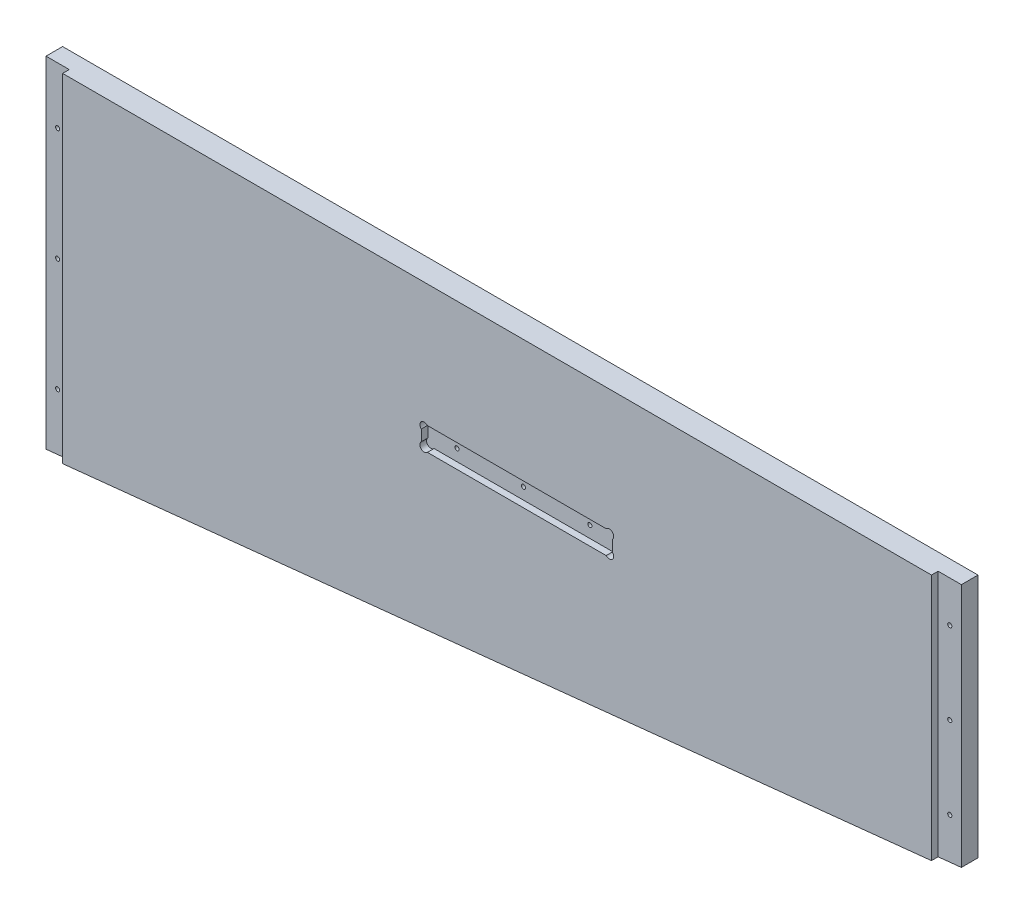
ISO-10303-21;
HEADER;
FILE_DESCRIPTION(('STEP AP214'),'2;1');
FILE_NAME('part.step','',(''),(''),'','','');
FILE_SCHEMA(('AUTOMOTIVE_DESIGN { 1 0 10303 214 1 1 1 1 }'));
ENDSEC;
DATA;
#1=APPLICATION_CONTEXT('core data for automotive mechanical design processes');
#2=APPLICATION_PROTOCOL_DEFINITION('international standard','automotive_design',2000,#1);
#3=PRODUCT_CONTEXT('',#1,'mechanical');
#4=PRODUCT('Part','Part','',(#3));
#5=PRODUCT_RELATED_PRODUCT_CATEGORY('part','',(#4));
#6=PRODUCT_DEFINITION_FORMATION('','',#4);
#7=PRODUCT_DEFINITION_CONTEXT('part definition',#1,'design');
#8=PRODUCT_DEFINITION('design','',#6,#7);
#9=PRODUCT_DEFINITION_SHAPE('','',#8);
#10=(LENGTH_UNIT() NAMED_UNIT(*) SI_UNIT(.MILLI.,.METRE.));
#11=(NAMED_UNIT(*) PLANE_ANGLE_UNIT() SI_UNIT($,.RADIAN.));
#12=(NAMED_UNIT(*) SI_UNIT($,.STERADIAN.) SOLID_ANGLE_UNIT());
#13=UNCERTAINTY_MEASURE_WITH_UNIT(LENGTH_MEASURE(1.E-05),#10,'distance_accuracy_value','');
#14=(GEOMETRIC_REPRESENTATION_CONTEXT(3) GLOBAL_UNCERTAINTY_ASSIGNED_CONTEXT((#13)) GLOBAL_UNIT_ASSIGNED_CONTEXT((#10,
#11,#12)) REPRESENTATION_CONTEXT('',''));
#15=CARTESIAN_POINT('',(0.,0.,0.));
#16=DIRECTION('',(0.,0.,1.));
#17=DIRECTION('',(1.,0.,0.));
#18=AXIS2_PLACEMENT_3D('',#15,#16,#17);
#19=CARTESIAN_POINT('',(839.47,-5504.1296031746,-17.78));
#20=DIRECTION('',(1.,0.,0.));
#21=DIRECTION('',(0.,0.,-1.));
#22=AXIS2_PLACEMENT_3D('',#19,#20,#21);
#23=PLANE('',#22);
#24=DIRECTION('',(0.,0.,1.));
#25=VECTOR('',#24,1.);
#26=CARTESIAN_POINT('',(839.47,-5504.1296031746,-17.78));
#27=LINE('',#26,#25);
#28=CARTESIAN_POINT('',(839.47,-5504.1296031746,-5.08));
#29=VERTEX_POINT('',#28);
#30=CARTESIAN_POINT('',(839.47,-5504.1296031746,0.));
#31=VERTEX_POINT('',#30);
#32=EDGE_CURVE('E585',#29,#31,#27,.T.);
#33=ORIENTED_EDGE('',*,*,#32,.F.);
#34=DIRECTION('',(0.,1.,0.));
#35=VECTOR('',#34,1.);
#36=CARTESIAN_POINT('',(839.47,-5504.1296031746,-5.08));
#37=LINE('',#36,#35);
#38=CARTESIAN_POINT('',(839.47,-5314.95,-5.08));
#39=VERTEX_POINT('',#38);
#40=EDGE_CURVE('E192',#29,#39,#37,.T.);
#41=ORIENTED_EDGE('',*,*,#40,.T.);
#42=DIRECTION('',(0.,0.,1.));
#43=VECTOR('',#42,1.);
#44=CARTESIAN_POINT('',(839.47,-5314.95,-17.78));
#45=LINE('',#44,#43);
#46=CARTESIAN_POINT('',(839.47,-5314.95,0.));
#47=VERTEX_POINT('',#46);
#48=EDGE_CURVE('E195',#39,#47,#45,.T.);
#49=ORIENTED_EDGE('',*,*,#48,.T.);
#50=DIRECTION('',(0.,1.,0.));
#51=VECTOR('',#50,1.);
#52=CARTESIAN_POINT('',(839.47,-5504.1296031746,0.));
#53=LINE('',#52,#51);
#54=EDGE_CURVE('E588',#31,#47,#53,.T.);
#55=ORIENTED_EDGE('',*,*,#54,.F.);
#56=EDGE_LOOP('',(#33,#41,#49,#55));
#57=FACE_BOUND('',#56,.T.);
#58=ADVANCED_FACE('F30',(#57),#23,.T.);
#59=CARTESIAN_POINT('',(174.9425,-5314.95,-17.78));
#60=DIRECTION('',(-1.,0.,0.));
#61=DIRECTION('',(0.,-1.,0.));
#62=AXIS2_PLACEMENT_3D('',#59,#60,#61);
#63=PLANE('',#62);
#64=DIRECTION('',(0.,0.,1.));
#65=VECTOR('',#64,1.);
#66=CARTESIAN_POINT('',(174.9425,-5314.95,-17.78));
#67=LINE('',#66,#65);
#68=CARTESIAN_POINT('',(174.9425,-5314.95,-5.08));
#69=VERTEX_POINT('',#68);
#70=CARTESIAN_POINT('',(174.9425,-5314.95,0.));
#71=VERTEX_POINT('',#70);
#72=EDGE_CURVE('E39',#69,#71,#67,.T.);
#73=ORIENTED_EDGE('',*,*,#72,.F.);
#74=DIRECTION('',(0.,-1.,0.));
#75=VECTOR('',#74,1.);
#76=CARTESIAN_POINT('',(174.9425,-5573.4453968254,-5.08));
#77=LINE('',#76,#75);
#78=CARTESIAN_POINT('',(174.9425,-5573.4453968254,-5.08));
#79=VERTEX_POINT('',#78);
#80=EDGE_CURVE('E610',#69,#79,#77,.T.);
#81=ORIENTED_EDGE('',*,*,#80,.T.);
#82=DIRECTION('',(0.,0.,1.));
#83=VECTOR('',#82,1.);
#84=CARTESIAN_POINT('',(174.9425,-5573.4453968254,-17.78));
#85=LINE('',#84,#83);
#86=CARTESIAN_POINT('',(174.9425,-5573.4453968254,0.));
#87=VERTEX_POINT('',#86);
#88=EDGE_CURVE('E11',#79,#87,#85,.T.);
#89=ORIENTED_EDGE('',*,*,#88,.T.);
#90=DIRECTION('',(0.,-1.,0.));
#91=VECTOR('',#90,1.);
#92=CARTESIAN_POINT('',(174.9425,-5314.95,0.));
#93=LINE('',#92,#91);
#94=EDGE_CURVE('E593',#71,#87,#93,.T.);
#95=ORIENTED_EDGE('',*,*,#94,.F.);
#96=EDGE_LOOP('',(#73,#81,#89,#95));
#97=FACE_BOUND('',#96,.T.);
#98=ADVANCED_FACE('F324',(#97),#63,.T.);
#99=CARTESIAN_POINT('',(174.9425,-5573.4453968254,-17.78));
#100=DIRECTION('',(0.10374552875936,-0.994603873540839,0.));
#101=DIRECTION('',(0.994603873540839,0.10374552875936,0.));
#102=AXIS2_PLACEMENT_3D('',#99,#100,#101);
#103=PLANE('',#102);
#104=DIRECTION('',(0.994603873540839,0.10374552875936,0.));
#105=VECTOR('',#104,1.);
#106=CARTESIAN_POINT('',(174.9425,-5573.4453968254,0.));
#107=LINE('',#106,#105);
#108=EDGE_CURVE('E582',#87,#31,#107,.T.);
#109=ORIENTED_EDGE('',*,*,#108,.F.);
#110=ORIENTED_EDGE('',*,*,#88,.F.);
#111=DIRECTION('',(-0.994603873540837,-0.103745528759374,0.));
#112=VECTOR('',#111,1.);
#113=CARTESIAN_POINT('',(157.1625,-5575.3,-5.08));
#114=LINE('',#113,#112);
#115=CARTESIAN_POINT('',(157.1625,-5575.3,-5.08));
#116=VERTEX_POINT('',#115);
#117=EDGE_CURVE('E614',#79,#116,#114,.T.);
#118=ORIENTED_EDGE('',*,*,#117,.T.);
#119=DIRECTION('',(0.,0.,-1.));
#120=VECTOR('',#119,1.);
#121=CARTESIAN_POINT('',(157.1625,-5575.3,-5.08));
#122=LINE('',#121,#120);
#123=CARTESIAN_POINT('',(157.1625,-5575.3,-17.78));
#124=VERTEX_POINT('',#123);
#125=EDGE_CURVE('E630',#116,#124,#122,.T.);
#126=ORIENTED_EDGE('',*,*,#125,.T.);
#127=DIRECTION('',(0.994603873540839,0.10374552875936,0.));
#128=VECTOR('',#127,1.);
#129=CARTESIAN_POINT('',(174.9425,-5573.4453968254,-17.78));
#130=LINE('',#129,#128);
#131=CARTESIAN_POINT('',(857.25,-5502.275,-17.78));
#132=VERTEX_POINT('',#131);
#133=EDGE_CURVE('E597',#124,#132,#130,.T.);
#134=ORIENTED_EDGE('',*,*,#133,.T.);
#135=DIRECTION('',(0.,0.,-1.));
#136=VECTOR('',#135,1.);
#137=CARTESIAN_POINT('',(857.25,-5502.275,-5.08));
#138=LINE('',#137,#136);
#139=CARTESIAN_POINT('',(857.25,-5502.275,-5.08));
#140=VERTEX_POINT('',#139);
#141=EDGE_CURVE('E627',#140,#132,#138,.T.);
#142=ORIENTED_EDGE('',*,*,#141,.F.);
#143=DIRECTION('',(-0.994603873540837,-0.103745528759374,0.));
#144=VECTOR('',#143,1.);
#145=CARTESIAN_POINT('',(857.25,-5502.275,-5.08));
#146=LINE('',#145,#144);
#147=EDGE_CURVE('E201',#140,#29,#146,.T.);
#148=ORIENTED_EDGE('',*,*,#147,.T.);
#149=ORIENTED_EDGE('',*,*,#32,.T.);
#150=EDGE_LOOP('',(#109,#110,#118,#126,#134,#142,#148,#149));
#151=FACE_BOUND('',#150,.T.);
#152=ADVANCED_FACE('F32',(#151),#103,.T.);
#153=CARTESIAN_POINT('',(839.47,-5314.95,-17.78));
#154=DIRECTION('',(0.,1.,0.));
#155=DIRECTION('',(0.,0.,1.));
#156=AXIS2_PLACEMENT_3D('',#153,#154,#155);
#157=PLANE('',#156);
#158=DIRECTION('',(-1.,0.,0.));
#159=VECTOR('',#158,1.);
#160=CARTESIAN_POINT('',(839.47,-5314.95,0.));
#161=LINE('',#160,#159);
#162=EDGE_CURVE('E595',#47,#71,#161,.T.);
#163=ORIENTED_EDGE('',*,*,#162,.F.);
#164=ORIENTED_EDGE('',*,*,#48,.F.);
#165=DIRECTION('',(1.,0.,0.));
#166=VECTOR('',#165,1.);
#167=CARTESIAN_POINT('',(839.47,-5314.95,-5.08));
#168=LINE('',#167,#166);
#169=CARTESIAN_POINT('',(857.25,-5314.95,-5.08));
#170=VERTEX_POINT('',#169);
#171=EDGE_CURVE('E55',#39,#170,#168,.T.);
#172=ORIENTED_EDGE('',*,*,#171,.T.);
#173=DIRECTION('',(0.,0.,-1.));
#174=VECTOR('',#173,1.);
#175=CARTESIAN_POINT('',(857.25,-5314.95,-5.08));
#176=LINE('',#175,#174);
#177=CARTESIAN_POINT('',(857.25,-5314.95,-17.78));
#178=VERTEX_POINT('',#177);
#179=EDGE_CURVE('E204',#170,#178,#176,.T.);
#180=ORIENTED_EDGE('',*,*,#179,.T.);
#181=DIRECTION('',(-1.,0.,0.));
#182=VECTOR('',#181,1.);
#183=CARTESIAN_POINT('',(839.47,-5314.95,-17.78));
#184=LINE('',#183,#182);
#185=CARTESIAN_POINT('',(157.1625,-5314.95,-17.78));
#186=VERTEX_POINT('',#185);
#187=EDGE_CURVE('E599',#178,#186,#184,.T.);
#188=ORIENTED_EDGE('',*,*,#187,.T.);
#189=DIRECTION('',(0.,0.,-1.));
#190=VECTOR('',#189,1.);
#191=CARTESIAN_POINT('',(157.1625,-5314.95,-5.08));
#192=LINE('',#191,#190);
#193=CARTESIAN_POINT('',(157.1625,-5314.95,-5.08));
#194=VERTEX_POINT('',#193);
#195=EDGE_CURVE('E589',#194,#186,#192,.T.);
#196=ORIENTED_EDGE('',*,*,#195,.F.);
#197=DIRECTION('',(1.,0.,0.));
#198=VECTOR('',#197,1.);
#199=CARTESIAN_POINT('',(174.9425,-5314.95,-5.08));
#200=LINE('',#199,#198);
#201=EDGE_CURVE('E624',#194,#69,#200,.T.);
#202=ORIENTED_EDGE('',*,*,#201,.T.);
#203=ORIENTED_EDGE('',*,*,#72,.T.);
#204=EDGE_LOOP('',(#163,#164,#172,#180,#188,#196,#202,#203));
#205=FACE_BOUND('',#204,.T.);
#206=ADVANCED_FACE('F333',(#205),#157,.T.);
#207=CARTESIAN_POINT('',(174.9425,-5573.4453968254,-17.78));
#208=DIRECTION('',(0.,0.,-1.));
#209=DIRECTION('',(-1.,0.,0.));
#210=AXIS2_PLACEMENT_3D('',#207,#208,#209);
#211=PLANE('',#210);
#212=CARTESIAN_POINT('',(471.4875,-5417.566,-17.78));
#213=DIRECTION('',(0.,0.,-1.));
#214=DIRECTION('',(-1.,0.,0.));
#215=AXIS2_PLACEMENT_3D('',#212,#213,#214);
#216=CIRCLE('',#215,1.58749999999969);
#217=CARTESIAN_POINT('',(469.9,-5417.566,-17.78));
#218=VERTEX_POINT('',#217);
#219=EDGE_CURVE('E246',#218,#218,#216,.F.);
#220=ORIENTED_EDGE('',*,*,#219,.T.);
#221=EDGE_LOOP('',(#220));
#222=FACE_BOUND('',#221,.T.);
#223=CARTESIAN_POINT('',(522.2875,-5417.566,-17.78));
#224=DIRECTION('',(0.,0.,-1.));
#225=DIRECTION('',(-1.,0.,0.));
#226=AXIS2_PLACEMENT_3D('',#223,#224,#225);
#227=CIRCLE('',#226,1.58749999999964);
#228=CARTESIAN_POINT('',(520.7,-5417.566,-17.78));
#229=VERTEX_POINT('',#228);
#230=EDGE_CURVE('E236',#229,#229,#227,.F.);
#231=ORIENTED_EDGE('',*,*,#230,.T.);
#232=EDGE_LOOP('',(#231));
#233=FACE_BOUND('',#232,.T.);
#234=CARTESIAN_POINT('',(573.0875,-5417.566,-17.78));
#235=DIRECTION('',(0.,0.,-1.));
#236=DIRECTION('',(-1.,0.,0.));
#237=AXIS2_PLACEMENT_3D('',#234,#235,#236);
#238=CIRCLE('',#237,1.58749999999985);
#239=CARTESIAN_POINT('',(571.5,-5417.566,-17.78));
#240=VERTEX_POINT('',#239);
#241=EDGE_CURVE('E233',#240,#240,#238,.F.);
#242=ORIENTED_EDGE('',*,*,#241,.T.);
#243=EDGE_LOOP('',(#242));
#244=FACE_BOUND('',#243,.T.);
#245=CARTESIAN_POINT('',(848.36,-5346.32538359912,-17.78));
#246=DIRECTION('',(0.,0.,-1.));
#247=DIRECTION('',(-1.,0.,0.));
#248=AXIS2_PLACEMENT_3D('',#245,#246,#247);
#249=CIRCLE('',#248,1.58749999999985);
#250=CARTESIAN_POINT('',(846.7725,-5346.32538359912,-17.78));
#251=VERTEX_POINT('',#250);
#252=EDGE_CURVE('E230',#251,#251,#249,.F.);
#253=ORIENTED_EDGE('',*,*,#252,.T.);
#254=EDGE_LOOP('',(#253));
#255=FACE_BOUND('',#254,.T.);
#256=CARTESIAN_POINT('',(848.36,-5409.07615079482,-17.78));
#257=DIRECTION('',(0.,0.,-1.));
#258=DIRECTION('',(-1.,0.,0.));
#259=AXIS2_PLACEMENT_3D('',#256,#257,#258);
#260=CIRCLE('',#259,1.58749999999996);
#261=CARTESIAN_POINT('',(846.7725,-5409.07615079482,-17.78));
#262=VERTEX_POINT('',#261);
#263=EDGE_CURVE('E226',#262,#262,#260,.F.);
#264=ORIENTED_EDGE('',*,*,#263,.T.);
#265=EDGE_LOOP('',(#264));
#266=FACE_BOUND('',#265,.T.);
#267=CARTESIAN_POINT('',(848.36,-5471.82691799052,-17.78));
#268=DIRECTION('',(0.,0.,-1.));
#269=DIRECTION('',(-1.,0.,0.));
#270=AXIS2_PLACEMENT_3D('',#267,#268,#269);
#271=CIRCLE('',#270,1.58749999999964);
#272=CARTESIAN_POINT('',(846.7725,-5471.82691799052,-17.78));
#273=VERTEX_POINT('',#272);
#274=EDGE_CURVE('E222',#273,#273,#271,.F.);
#275=ORIENTED_EDGE('',*,*,#274,.T.);
#276=EDGE_LOOP('',(#275));
#277=FACE_BOUND('',#276,.T.);
#278=CARTESIAN_POINT('',(166.0525,-5358.18711640088,-17.78));
#279=DIRECTION('',(0.,0.,-1.));
#280=DIRECTION('',(-1.,0.,0.));
#281=AXIS2_PLACEMENT_3D('',#278,#279,#280);
#282=CIRCLE('',#281,1.58750000000006);
#283=CARTESIAN_POINT('',(164.465,-5358.18711640088,-17.78));
#284=VERTEX_POINT('',#283);
#285=EDGE_CURVE('E218',#284,#284,#282,.F.);
#286=ORIENTED_EDGE('',*,*,#285,.T.);
#287=EDGE_LOOP('',(#286));
#288=FACE_BOUND('',#287,.T.);
#289=CARTESIAN_POINT('',(166.0525,-5444.66134920518,-17.78));
#290=DIRECTION('',(0.,0.,-1.));
#291=DIRECTION('',(-1.,0.,0.));
#292=AXIS2_PLACEMENT_3D('',#289,#290,#291);
#293=CIRCLE('',#292,1.58749999999974);
#294=CARTESIAN_POINT('',(164.465,-5444.66134920518,-17.78));
#295=VERTEX_POINT('',#294);
#296=EDGE_CURVE('E214',#295,#295,#293,.F.);
#297=ORIENTED_EDGE('',*,*,#296,.T.);
#298=EDGE_LOOP('',(#297));
#299=FACE_BOUND('',#298,.T.);
#300=CARTESIAN_POINT('',(166.0525,-5531.13558200948,-17.78));
#301=DIRECTION('',(0.,0.,-1.));
#302=DIRECTION('',(-1.,0.,0.));
#303=AXIS2_PLACEMENT_3D('',#300,#301,#302);
#304=CIRCLE('',#303,1.58750000000025);
#305=CARTESIAN_POINT('',(164.465,-5531.13558200948,-17.78));
#306=VERTEX_POINT('',#305);
#307=EDGE_CURVE('E210',#306,#306,#304,.F.);
#308=ORIENTED_EDGE('',*,*,#307,.T.);
#309=EDGE_LOOP('',(#308));
#310=FACE_BOUND('',#309,.T.);
#311=ORIENTED_EDGE('',*,*,#133,.F.);
#312=DIRECTION('',(0.,1.,0.));
#313=VECTOR('',#312,1.);
#314=CARTESIAN_POINT('',(157.1625,-5314.95,-17.78));
#315=LINE('',#314,#313);
#316=EDGE_CURVE('E615',#124,#186,#315,.T.);
#317=ORIENTED_EDGE('',*,*,#316,.T.);
#318=ORIENTED_EDGE('',*,*,#187,.F.);
#319=DIRECTION('',(0.,-1.,0.));
#320=VECTOR('',#319,1.);
#321=CARTESIAN_POINT('',(857.25,-5314.95,-17.78));
#322=LINE('',#321,#320);
#323=EDGE_CURVE('E171',#178,#132,#322,.T.);
#324=ORIENTED_EDGE('',*,*,#323,.T.);
#325=EDGE_LOOP('',(#311,#317,#318,#324));
#326=FACE_BOUND('',#325,.T.);
#327=ADVANCED_FACE('F335',(#222,#233,#244,#255,#266,#277,#288,#299,#310,#326),#211,.T.);
#328=CARTESIAN_POINT('',(174.9425,-5573.4453968254,0.));
#329=DIRECTION('',(0.,0.,-1.));
#330=DIRECTION('',(-1.,0.,0.));
#331=AXIS2_PLACEMENT_3D('',#328,#329,#330);
#332=PLANE('',#331);
#333=DIRECTION('',(-1.,0.,0.));
#334=VECTOR('',#333,1.);
#335=CARTESIAN_POINT('',(595.312500001227,-5408.67600000123,0.));
#336=LINE('',#335,#334);
#337=CARTESIAN_POINT('',(590.646095122434,-5408.67600000123,0.));
#338=VERTEX_POINT('',#337);
#339=CARTESIAN_POINT('',(453.928904877565,-5408.67600000123,0.));
#340=VERTEX_POINT('',#339);
#341=EDGE_CURVE('E185',#338,#340,#336,.T.);
#342=ORIENTED_EDGE('',*,*,#341,.F.);
#343=CARTESIAN_POINT('',(593.067435970959,-5410.9210640315,0.));
#344=DIRECTION('',(0.,0.,1.));
#345=DIRECTION('',(1.,0.,0.));
#346=AXIS2_PLACEMENT_3D('',#343,#344,#345);
#347=CIRCLE('',#346,3.30200000071786);
#348=CARTESIAN_POINT('',(595.312500001227,-5413.34240488002,0.));
#349=VERTEX_POINT('',#348);
#350=EDGE_CURVE('E154',#349,#338,#347,.T.);
#351=ORIENTED_EDGE('',*,*,#350,.F.);
#352=DIRECTION('',(0.,1.,0.));
#353=VECTOR('',#352,1.);
#354=CARTESIAN_POINT('',(595.312500001227,-5408.67600000123,0.));
#355=LINE('',#354,#353);
#356=CARTESIAN_POINT('',(595.312500001227,-5421.78959512341,0.));
#357=VERTEX_POINT('',#356);
#358=EDGE_CURVE('E163',#357,#349,#355,.T.);
#359=ORIENTED_EDGE('',*,*,#358,.F.);
#360=CARTESIAN_POINT('',(593.06743597096,-5424.21093597096,0.));
#361=DIRECTION('',(0.,0.,1.));
#362=DIRECTION('',(1.,0.,0.));
#363=AXIS2_PLACEMENT_3D('',#360,#361,#362);
#364=CIRCLE('',#363,3.30200000000012);
#365=CARTESIAN_POINT('',(590.646095123413,-5426.45600000123,0.));
#366=VERTEX_POINT('',#365);
#367=EDGE_CURVE('E263',#366,#357,#364,.T.);
#368=ORIENTED_EDGE('',*,*,#367,.F.);
#369=DIRECTION('',(1.,0.,0.));
#370=VECTOR('',#369,1.);
#371=CARTESIAN_POINT('',(449.262499998773,-5426.45600000123,0.));
#372=LINE('',#371,#370);
#373=CARTESIAN_POINT('',(453.928904876584,-5426.45600000123,0.));
#374=VERTEX_POINT('',#373);
#375=EDGE_CURVE('E180',#374,#366,#372,.T.);
#376=ORIENTED_EDGE('',*,*,#375,.F.);
#377=CARTESIAN_POINT('',(451.507564029041,-5424.21093597096,0.));
#378=DIRECTION('',(0.,0.,1.));
#379=DIRECTION('',(1.,0.,0.));
#380=AXIS2_PLACEMENT_3D('',#377,#378,#379);
#381=CIRCLE('',#380,3.30199999999822);
#382=CARTESIAN_POINT('',(449.262499998773,-5421.78959512341,0.));
#383=VERTEX_POINT('',#382);
#384=EDGE_CURVE('E271',#383,#374,#381,.T.);
#385=ORIENTED_EDGE('',*,*,#384,.F.);
#386=DIRECTION('',(0.,-1.,0.));
#387=VECTOR('',#386,1.);
#388=CARTESIAN_POINT('',(449.262499998773,-5408.67600000123,0.));
#389=LINE('',#388,#387);
#390=CARTESIAN_POINT('',(449.262499998773,-5413.34240488002,0.));
#391=VERTEX_POINT('',#390);
#392=EDGE_CURVE('E177',#391,#383,#389,.T.);
#393=ORIENTED_EDGE('',*,*,#392,.F.);
#394=CARTESIAN_POINT('',(451.50756402904,-5410.9210640315,0.));
#395=DIRECTION('',(0.,0.,1.));
#396=DIRECTION('',(1.,0.,0.));
#397=AXIS2_PLACEMENT_3D('',#394,#395,#396);
#398=CIRCLE('',#397,3.30200000071828);
#399=EDGE_CURVE('E280',#340,#391,#398,.T.);
#400=ORIENTED_EDGE('',*,*,#399,.F.);
#401=EDGE_LOOP('',(#342,#351,#359,#368,#376,#385,#393,#400));
#402=FACE_BOUND('',#401,.T.);
#403=ORIENTED_EDGE('',*,*,#108,.T.);
#404=ORIENTED_EDGE('',*,*,#54,.T.);
#405=ORIENTED_EDGE('',*,*,#162,.T.);
#406=ORIENTED_EDGE('',*,*,#94,.T.);
#407=EDGE_LOOP('',(#403,#404,#405,#406));
#408=FACE_BOUND('',#407,.T.);
#409=ADVANCED_FACE('F300',(#402,#408),#332,.F.);
#410=CARTESIAN_POINT('',(157.1625,-5314.95,-5.08));
#411=DIRECTION('',(-1.,0.,0.));
#412=DIRECTION('',(0.,-1.,0.));
#413=AXIS2_PLACEMENT_3D('',#410,#411,#412);
#414=PLANE('',#413);
#415=ORIENTED_EDGE('',*,*,#316,.F.);
#416=ORIENTED_EDGE('',*,*,#125,.F.);
#417=DIRECTION('',(0.,1.,0.));
#418=VECTOR('',#417,1.);
#419=CARTESIAN_POINT('',(157.1625,-5314.95,-5.08));
#420=LINE('',#419,#418);
#421=EDGE_CURVE('E621',#116,#194,#420,.T.);
#422=ORIENTED_EDGE('',*,*,#421,.T.);
#423=ORIENTED_EDGE('',*,*,#195,.T.);
#424=EDGE_LOOP('',(#415,#416,#422,#423));
#425=FACE_BOUND('',#424,.T.);
#426=ADVANCED_FACE('F340',(#425),#414,.T.);
#427=CARTESIAN_POINT('',(174.9425,-5314.95,-5.08));
#428=DIRECTION('',(0.,0.,1.));
#429=DIRECTION('',(1.,0.,0.));
#430=AXIS2_PLACEMENT_3D('',#427,#428,#429);
#431=PLANE('',#430);
#432=CARTESIAN_POINT('',(166.0525,-5358.18711640088,-5.08));
#433=DIRECTION('',(0.,0.,1.));
#434=DIRECTION('',(1.,0.,0.));
#435=AXIS2_PLACEMENT_3D('',#432,#433,#434);
#436=CIRCLE('',#435,1.58750000000006);
#437=CARTESIAN_POINT('',(167.64,-5358.18711640088,-5.08));
#438=VERTEX_POINT('',#437);
#439=EDGE_CURVE('E215',#438,#438,#436,.T.);
#440=ORIENTED_EDGE('',*,*,#439,.F.);
#441=EDGE_LOOP('',(#440));
#442=FACE_BOUND('',#441,.T.);
#443=CARTESIAN_POINT('',(166.0525,-5444.66134920518,-5.08));
#444=DIRECTION('',(0.,0.,1.));
#445=DIRECTION('',(1.,0.,0.));
#446=AXIS2_PLACEMENT_3D('',#443,#444,#445);
#447=CIRCLE('',#446,1.58749999999974);
#448=CARTESIAN_POINT('',(167.64,-5444.66134920518,-5.08));
#449=VERTEX_POINT('',#448);
#450=EDGE_CURVE('E211',#449,#449,#447,.T.);
#451=ORIENTED_EDGE('',*,*,#450,.F.);
#452=EDGE_LOOP('',(#451));
#453=FACE_BOUND('',#452,.T.);
#454=CARTESIAN_POINT('',(166.0525,-5531.13558200948,-5.08));
#455=DIRECTION('',(0.,0.,1.));
#456=DIRECTION('',(1.,0.,0.));
#457=AXIS2_PLACEMENT_3D('',#454,#455,#456);
#458=CIRCLE('',#457,1.58750000000025);
#459=CARTESIAN_POINT('',(167.64,-5531.13558200948,-5.08));
#460=VERTEX_POINT('',#459);
#461=EDGE_CURVE('E207',#460,#460,#458,.T.);
#462=ORIENTED_EDGE('',*,*,#461,.F.);
#463=EDGE_LOOP('',(#462));
#464=FACE_BOUND('',#463,.T.);
#465=ORIENTED_EDGE('',*,*,#80,.F.);
#466=ORIENTED_EDGE('',*,*,#201,.F.);
#467=ORIENTED_EDGE('',*,*,#421,.F.);
#468=ORIENTED_EDGE('',*,*,#117,.F.);
#469=EDGE_LOOP('',(#465,#466,#467,#468));
#470=FACE_BOUND('',#469,.T.);
#471=ADVANCED_FACE('F346',(#442,#453,#464,#470),#431,.T.);
#472=CARTESIAN_POINT('',(857.25,-5314.95,-5.08));
#473=DIRECTION('',(1.,0.,0.));
#474=DIRECTION('',(0.,0.,-1.));
#475=AXIS2_PLACEMENT_3D('',#472,#473,#474);
#476=PLANE('',#475);
#477=ORIENTED_EDGE('',*,*,#323,.F.);
#478=ORIENTED_EDGE('',*,*,#179,.F.);
#479=DIRECTION('',(0.,-1.,0.));
#480=VECTOR('',#479,1.);
#481=CARTESIAN_POINT('',(857.25,-5314.95,-5.08));
#482=LINE('',#481,#480);
#483=EDGE_CURVE('E189',#170,#140,#482,.T.);
#484=ORIENTED_EDGE('',*,*,#483,.T.);
#485=ORIENTED_EDGE('',*,*,#141,.T.);
#486=EDGE_LOOP('',(#477,#478,#484,#485));
#487=FACE_BOUND('',#486,.T.);
#488=ADVANCED_FACE('F350',(#487),#476,.T.);
#489=CARTESIAN_POINT('',(839.47,-5314.95,-5.08));
#490=DIRECTION('',(0.,0.,-1.));
#491=DIRECTION('',(-1.,0.,0.));
#492=AXIS2_PLACEMENT_3D('',#489,#490,#491);
#493=PLANE('',#492);
#494=CARTESIAN_POINT('',(848.36,-5346.32538359912,-5.08));
#495=DIRECTION('',(0.,0.,-1.));
#496=DIRECTION('',(-1.,0.,0.));
#497=AXIS2_PLACEMENT_3D('',#494,#495,#496);
#498=CIRCLE('',#497,1.58749999999985);
#499=CARTESIAN_POINT('',(846.7725,-5346.32538359912,-5.08));
#500=VERTEX_POINT('',#499);
#501=EDGE_CURVE('E227',#500,#500,#498,.T.);
#502=ORIENTED_EDGE('',*,*,#501,.T.);
#503=EDGE_LOOP('',(#502));
#504=FACE_BOUND('',#503,.T.);
#505=CARTESIAN_POINT('',(848.36,-5409.07615079482,-5.08));
#506=DIRECTION('',(0.,0.,-1.));
#507=DIRECTION('',(-1.,0.,0.));
#508=AXIS2_PLACEMENT_3D('',#505,#506,#507);
#509=CIRCLE('',#508,1.58749999999996);
#510=CARTESIAN_POINT('',(846.7725,-5409.07615079482,-5.08));
#511=VERTEX_POINT('',#510);
#512=EDGE_CURVE('E223',#511,#511,#509,.T.);
#513=ORIENTED_EDGE('',*,*,#512,.T.);
#514=EDGE_LOOP('',(#513));
#515=FACE_BOUND('',#514,.T.);
#516=CARTESIAN_POINT('',(848.36,-5471.82691799052,-5.08));
#517=DIRECTION('',(0.,0.,-1.));
#518=DIRECTION('',(-1.,0.,0.));
#519=AXIS2_PLACEMENT_3D('',#516,#517,#518);
#520=CIRCLE('',#519,1.58749999999964);
#521=CARTESIAN_POINT('',(846.7725,-5471.82691799052,-5.08));
#522=VERTEX_POINT('',#521);
#523=EDGE_CURVE('E219',#522,#522,#520,.T.);
#524=ORIENTED_EDGE('',*,*,#523,.T.);
#525=EDGE_LOOP('',(#524));
#526=FACE_BOUND('',#525,.T.);
#527=ORIENTED_EDGE('',*,*,#40,.F.);
#528=ORIENTED_EDGE('',*,*,#147,.F.);
#529=ORIENTED_EDGE('',*,*,#483,.F.);
#530=ORIENTED_EDGE('',*,*,#171,.F.);
#531=EDGE_LOOP('',(#527,#528,#529,#530));
#532=FACE_BOUND('',#531,.T.);
#533=ADVANCED_FACE('F354',(#504,#515,#526,#532),#493,.F.);
#534=CARTESIAN_POINT('',(449.262499998773,-5408.67600000123,-5.08));
#535=DIRECTION('',(-1.,0.,0.));
#536=DIRECTION('',(0.,0.,1.));
#537=AXIS2_PLACEMENT_3D('',#534,#535,#536);
#538=PLANE('',#537);
#539=ORIENTED_EDGE('',*,*,#392,.T.);
#540=DIRECTION('',(0.,0.,1.));
#541=VECTOR('',#540,1.);
#542=CARTESIAN_POINT('',(449.262499998773,-5421.78959512341,-14.4194663679435));
#543=LINE('',#542,#541);
#544=CARTESIAN_POINT('',(449.262499998772,-5421.78959512341,-5.08));
#545=VERTEX_POINT('',#544);
#546=EDGE_CURVE('E277',#383,#545,#543,.F.);
#547=ORIENTED_EDGE('',*,*,#546,.T.);
#548=DIRECTION('',(0.,-1.,0.));
#549=VECTOR('',#548,1.);
#550=CARTESIAN_POINT('',(449.262499998773,-5408.67600000123,-5.08));
#551=LINE('',#550,#549);
#552=CARTESIAN_POINT('',(449.262499998773,-5413.34240488002,-5.08));
#553=VERTEX_POINT('',#552);
#554=EDGE_CURVE('E173',#553,#545,#551,.T.);
#555=ORIENTED_EDGE('',*,*,#554,.F.);
#556=DIRECTION('',(0.,0.,1.));
#557=VECTOR('',#556,1.);
#558=CARTESIAN_POINT('',(449.262499998773,-5413.34240488002,-14.4194663679435));
#559=LINE('',#558,#557);
#560=EDGE_CURVE('E181',#553,#391,#559,.T.);
#561=ORIENTED_EDGE('',*,*,#560,.T.);
#562=EDGE_LOOP('',(#539,#547,#555,#561));
#563=FACE_BOUND('',#562,.T.);
#564=ADVANCED_FACE('F292',(#563),#538,.F.);
#565=CARTESIAN_POINT('',(595.312500001227,-5408.67600000123,-5.08));
#566=DIRECTION('',(0.,1.,0.));
#567=DIRECTION('',(0.,0.,1.));
#568=AXIS2_PLACEMENT_3D('',#565,#566,#567);
#569=PLANE('',#568);
#570=DIRECTION('',(-1.,0.,0.));
#571=VECTOR('',#570,1.);
#572=CARTESIAN_POINT('',(595.312500001227,-5408.67600000123,-5.08));
#573=LINE('',#572,#571);
#574=CARTESIAN_POINT('',(590.646095122434,-5408.67600000123,-5.08));
#575=VERTEX_POINT('',#574);
#576=CARTESIAN_POINT('',(453.928904877565,-5408.67600000123,-5.08));
#577=VERTEX_POINT('',#576);
#578=EDGE_CURVE('E168',#575,#577,#573,.T.);
#579=ORIENTED_EDGE('',*,*,#578,.F.);
#580=DIRECTION('',(0.,0.,1.));
#581=VECTOR('',#580,1.);
#582=CARTESIAN_POINT('',(590.646095122434,-5408.67600000123,-14.4194663679435));
#583=LINE('',#582,#581);
#584=EDGE_CURVE('E151',#575,#338,#583,.T.);
#585=ORIENTED_EDGE('',*,*,#584,.T.);
#586=ORIENTED_EDGE('',*,*,#341,.T.);
#587=DIRECTION('',(0.,0.,1.));
#588=VECTOR('',#587,1.);
#589=CARTESIAN_POINT('',(453.928904877565,-5408.67600000123,-14.4194663679435));
#590=LINE('',#589,#588);
#591=EDGE_CURVE('E285',#340,#577,#590,.F.);
#592=ORIENTED_EDGE('',*,*,#591,.T.);
#593=EDGE_LOOP('',(#579,#585,#586,#592));
#594=FACE_BOUND('',#593,.T.);
#595=ADVANCED_FACE('F310',(#594),#569,.F.);
#596=CARTESIAN_POINT('',(595.312500001227,-5408.67600000123,-5.08));
#597=DIRECTION('',(1.,0.,0.));
#598=DIRECTION('',(0.,0.,-1.));
#599=AXIS2_PLACEMENT_3D('',#596,#597,#598);
#600=PLANE('',#599);
#601=ORIENTED_EDGE('',*,*,#358,.T.);
#602=DIRECTION('',(0.,0.,1.));
#603=VECTOR('',#602,1.);
#604=CARTESIAN_POINT('',(595.312500001227,-5413.34240488002,-14.4194663679435));
#605=LINE('',#604,#603);
#606=CARTESIAN_POINT('',(595.312500001227,-5413.34240488002,-5.08));
#607=VERTEX_POINT('',#606);
#608=EDGE_CURVE('E148',#349,#607,#605,.F.);
#609=ORIENTED_EDGE('',*,*,#608,.T.);
#610=DIRECTION('',(0.,1.,0.));
#611=VECTOR('',#610,1.);
#612=CARTESIAN_POINT('',(595.312500001227,-5408.67600000123,-5.08));
#613=LINE('',#612,#611);
#614=CARTESIAN_POINT('',(595.312500001227,-5421.78959512341,-5.08));
#615=VERTEX_POINT('',#614);
#616=EDGE_CURVE('E161',#615,#607,#613,.T.);
#617=ORIENTED_EDGE('',*,*,#616,.F.);
#618=DIRECTION('',(0.,0.,1.));
#619=VECTOR('',#618,1.);
#620=CARTESIAN_POINT('',(595.312500001227,-5421.78959512341,-14.4194663679435));
#621=LINE('',#620,#619);
#622=EDGE_CURVE('E269',#615,#357,#621,.T.);
#623=ORIENTED_EDGE('',*,*,#622,.T.);
#624=EDGE_LOOP('',(#601,#609,#617,#623));
#625=FACE_BOUND('',#624,.T.);
#626=ADVANCED_FACE('F159',(#625),#600,.F.);
#627=CARTESIAN_POINT('',(449.262499998773,-5426.45600000123,-5.08));
#628=DIRECTION('',(0.,-1.,0.));
#629=DIRECTION('',(0.,0.,-1.));
#630=AXIS2_PLACEMENT_3D('',#627,#628,#629);
#631=PLANE('',#630);
#632=ORIENTED_EDGE('',*,*,#375,.T.);
#633=DIRECTION('',(0.,0.,1.));
#634=VECTOR('',#633,1.);
#635=CARTESIAN_POINT('',(590.646095123413,-5426.45600000123,-14.4194663679435));
#636=LINE('',#635,#634);
#637=CARTESIAN_POINT('',(590.646095123413,-5426.45600000123,-5.08));
#638=VERTEX_POINT('',#637);
#639=EDGE_CURVE('E266',#366,#638,#636,.F.);
#640=ORIENTED_EDGE('',*,*,#639,.T.);
#641=DIRECTION('',(1.,0.,0.));
#642=VECTOR('',#641,1.);
#643=CARTESIAN_POINT('',(449.262499998773,-5426.45600000123,-5.08));
#644=LINE('',#643,#642);
#645=CARTESIAN_POINT('',(453.928904876584,-5426.45600000123,-5.08));
#646=VERTEX_POINT('',#645);
#647=EDGE_CURVE('E169',#646,#638,#644,.T.);
#648=ORIENTED_EDGE('',*,*,#647,.F.);
#649=DIRECTION('',(0.,0.,1.));
#650=VECTOR('',#649,1.);
#651=CARTESIAN_POINT('',(453.928904876584,-5426.45600000123,-14.4194663679435));
#652=LINE('',#651,#650);
#653=EDGE_CURVE('E274',#646,#374,#652,.T.);
#654=ORIENTED_EDGE('',*,*,#653,.T.);
#655=EDGE_LOOP('',(#632,#640,#648,#654));
#656=FACE_BOUND('',#655,.T.);
#657=ADVANCED_FACE('F305',(#656),#631,.F.);
#658=CARTESIAN_POINT('',(449.262499998773,-5426.45600000123,-5.08));
#659=DIRECTION('',(0.,0.,1.));
#660=DIRECTION('',(1.,0.,0.));
#661=AXIS2_PLACEMENT_3D('',#658,#659,#660);
#662=PLANE('',#661);
#663=CARTESIAN_POINT('',(471.4875,-5417.566,-5.08));
#664=DIRECTION('',(0.,0.,1.));
#665=DIRECTION('',(1.,0.,0.));
#666=AXIS2_PLACEMENT_3D('',#663,#664,#665);
#667=CIRCLE('',#666,1.58749999999969);
#668=CARTESIAN_POINT('',(473.075,-5417.566,-5.08));
#669=VERTEX_POINT('',#668);
#670=EDGE_CURVE('E34',#669,#669,#667,.T.);
#671=ORIENTED_EDGE('',*,*,#670,.F.);
#672=EDGE_LOOP('',(#671));
#673=FACE_BOUND('',#672,.T.);
#674=CARTESIAN_POINT('',(522.2875,-5417.566,-5.08));
#675=DIRECTION('',(0.,0.,1.));
#676=DIRECTION('',(1.,0.,0.));
#677=AXIS2_PLACEMENT_3D('',#674,#675,#676);
#678=CIRCLE('',#677,1.58749999999964);
#679=CARTESIAN_POINT('',(523.875,-5417.566,-5.08));
#680=VERTEX_POINT('',#679);
#681=EDGE_CURVE('E234',#680,#680,#678,.T.);
#682=ORIENTED_EDGE('',*,*,#681,.F.);
#683=EDGE_LOOP('',(#682));
#684=FACE_BOUND('',#683,.T.);
#685=CARTESIAN_POINT('',(573.0875,-5417.566,-5.08));
#686=DIRECTION('',(0.,0.,1.));
#687=DIRECTION('',(1.,0.,0.));
#688=AXIS2_PLACEMENT_3D('',#685,#686,#687);
#689=CIRCLE('',#688,1.58749999999985);
#690=CARTESIAN_POINT('',(574.675,-5417.566,-5.08));
#691=VERTEX_POINT('',#690);
#692=EDGE_CURVE('E231',#691,#691,#689,.T.);
#693=ORIENTED_EDGE('',*,*,#692,.F.);
#694=EDGE_LOOP('',(#693));
#695=FACE_BOUND('',#694,.T.);
#696=CARTESIAN_POINT('',(593.067435970959,-5410.9210640315,-5.08));
#697=DIRECTION('',(0.,0.,1.));
#698=DIRECTION('',(1.,0.,0.));
#699=AXIS2_PLACEMENT_3D('',#696,#697,#698);
#700=CIRCLE('',#699,3.30200000071786);
#701=EDGE_CURVE('E145',#575,#607,#700,.F.);
#702=ORIENTED_EDGE('',*,*,#701,.F.);
#703=ORIENTED_EDGE('',*,*,#578,.T.);
#704=CARTESIAN_POINT('',(451.50756402904,-5410.9210640315,-5.08));
#705=DIRECTION('',(0.,0.,1.));
#706=DIRECTION('',(1.,0.,0.));
#707=AXIS2_PLACEMENT_3D('',#704,#705,#706);
#708=CIRCLE('',#707,3.30200000071828);
#709=EDGE_CURVE('E282',#553,#577,#708,.F.);
#710=ORIENTED_EDGE('',*,*,#709,.F.);
#711=ORIENTED_EDGE('',*,*,#554,.T.);
#712=CARTESIAN_POINT('',(451.507564029041,-5424.21093597096,-5.08));
#713=DIRECTION('',(0.,0.,1.));
#714=DIRECTION('',(1.,0.,0.));
#715=AXIS2_PLACEMENT_3D('',#712,#713,#714);
#716=CIRCLE('',#715,3.30199999999822);
#717=EDGE_CURVE('E47',#646,#545,#716,.F.);
#718=ORIENTED_EDGE('',*,*,#717,.F.);
#719=ORIENTED_EDGE('',*,*,#647,.T.);
#720=CARTESIAN_POINT('',(593.06743597096,-5424.21093597096,-5.08));
#721=DIRECTION('',(0.,0.,1.));
#722=DIRECTION('',(1.,0.,0.));
#723=AXIS2_PLACEMENT_3D('',#720,#721,#722);
#724=CIRCLE('',#723,3.30200000000012);
#725=EDGE_CURVE('E167',#615,#638,#724,.F.);
#726=ORIENTED_EDGE('',*,*,#725,.F.);
#727=ORIENTED_EDGE('',*,*,#616,.T.);
#728=EDGE_LOOP('',(#702,#703,#710,#711,#718,#719,#726,#727));
#729=FACE_BOUND('',#728,.T.);
#730=ADVANCED_FACE('F166',(#673,#684,#695,#729),#662,.T.);
#731=CARTESIAN_POINT('',(451.50756402904,-5410.9210640315,-14.4194663679435));
#732=DIRECTION('',(0.,0.,1.));
#733=DIRECTION('',(1.,0.,0.));
#734=AXIS2_PLACEMENT_3D('',#731,#732,#733);
#735=CYLINDRICAL_SURFACE('',#734,3.30200000071828);
#736=ORIENTED_EDGE('',*,*,#709,.T.);
#737=ORIENTED_EDGE('',*,*,#591,.F.);
#738=ORIENTED_EDGE('',*,*,#399,.T.);
#739=ORIENTED_EDGE('',*,*,#560,.F.);
#740=EDGE_LOOP('',(#736,#737,#738,#739));
#741=FACE_BOUND('',#740,.T.);
#742=ADVANCED_FACE('F313',(#741),#735,.F.);
#743=CARTESIAN_POINT('',(451.507564029041,-5424.21093597096,-14.4194663679435));
#744=DIRECTION('',(0.,0.,1.));
#745=DIRECTION('',(1.,0.,0.));
#746=AXIS2_PLACEMENT_3D('',#743,#744,#745);
#747=CYLINDRICAL_SURFACE('',#746,3.30199999999822);
#748=ORIENTED_EDGE('',*,*,#384,.T.);
#749=ORIENTED_EDGE('',*,*,#653,.F.);
#750=ORIENTED_EDGE('',*,*,#717,.T.);
#751=ORIENTED_EDGE('',*,*,#546,.F.);
#752=EDGE_LOOP('',(#748,#749,#750,#751));
#753=FACE_BOUND('',#752,.T.);
#754=ADVANCED_FACE('F296',(#753),#747,.F.);
#755=CARTESIAN_POINT('',(593.06743597096,-5424.21093597096,-14.4194663679435));
#756=DIRECTION('',(0.,0.,1.));
#757=DIRECTION('',(1.,0.,0.));
#758=AXIS2_PLACEMENT_3D('',#755,#756,#757);
#759=CYLINDRICAL_SURFACE('',#758,3.30200000000012);
#760=ORIENTED_EDGE('',*,*,#725,.T.);
#761=ORIENTED_EDGE('',*,*,#639,.F.);
#762=ORIENTED_EDGE('',*,*,#367,.T.);
#763=ORIENTED_EDGE('',*,*,#622,.F.);
#764=EDGE_LOOP('',(#760,#761,#762,#763));
#765=FACE_BOUND('',#764,.T.);
#766=ADVANCED_FACE('F308',(#765),#759,.F.);
#767=CARTESIAN_POINT('',(593.067435970959,-5410.9210640315,-14.4194663679435));
#768=DIRECTION('',(0.,0.,1.));
#769=DIRECTION('',(1.,0.,0.));
#770=AXIS2_PLACEMENT_3D('',#767,#768,#769);
#771=CYLINDRICAL_SURFACE('',#770,3.30200000071786);
#772=ORIENTED_EDGE('',*,*,#701,.T.);
#773=ORIENTED_EDGE('',*,*,#608,.F.);
#774=ORIENTED_EDGE('',*,*,#350,.T.);
#775=ORIENTED_EDGE('',*,*,#584,.F.);
#776=EDGE_LOOP('',(#772,#773,#774,#775));
#777=FACE_BOUND('',#776,.T.);
#778=ADVANCED_FACE('F147',(#777),#771,.F.);
#779=CARTESIAN_POINT('',(166.0525,-5531.13558200948,-22.2701280605353));
#780=DIRECTION('',(0.,0.,1.));
#781=DIRECTION('',(1.,0.,0.));
#782=AXIS2_PLACEMENT_3D('',#779,#780,#781);
#783=CYLINDRICAL_SURFACE('',#782,1.58750000000025);
#784=ORIENTED_EDGE('',*,*,#461,.T.);
#785=EDGE_LOOP('',(#784));
#786=FACE_BOUND('',#785,.T.);
#787=ORIENTED_EDGE('',*,*,#307,.F.);
#788=EDGE_LOOP('',(#787));
#789=FACE_BOUND('',#788,.T.);
#790=ADVANCED_FACE('F393',(#786,#789),#783,.F.);
#791=CARTESIAN_POINT('',(166.0525,-5444.66134920518,-22.2701280605353));
#792=DIRECTION('',(0.,0.,1.));
#793=DIRECTION('',(1.,0.,0.));
#794=AXIS2_PLACEMENT_3D('',#791,#792,#793);
#795=CYLINDRICAL_SURFACE('',#794,1.58749999999974);
#796=ORIENTED_EDGE('',*,*,#450,.T.);
#797=EDGE_LOOP('',(#796));
#798=FACE_BOUND('',#797,.T.);
#799=ORIENTED_EDGE('',*,*,#296,.F.);
#800=EDGE_LOOP('',(#799));
#801=FACE_BOUND('',#800,.T.);
#802=ADVANCED_FACE('F398',(#798,#801),#795,.F.);
#803=CARTESIAN_POINT('',(166.0525,-5358.18711640088,-22.2701280605353));
#804=DIRECTION('',(0.,0.,1.));
#805=DIRECTION('',(1.,0.,0.));
#806=AXIS2_PLACEMENT_3D('',#803,#804,#805);
#807=CYLINDRICAL_SURFACE('',#806,1.58750000000006);
#808=ORIENTED_EDGE('',*,*,#439,.T.);
#809=EDGE_LOOP('',(#808));
#810=FACE_BOUND('',#809,.T.);
#811=ORIENTED_EDGE('',*,*,#285,.F.);
#812=EDGE_LOOP('',(#811));
#813=FACE_BOUND('',#812,.T.);
#814=ADVANCED_FACE('F410',(#810,#813),#807,.F.);
#815=CARTESIAN_POINT('',(848.36,-5471.82691799052,-22.2701280605353));
#816=DIRECTION('',(0.,0.,1.));
#817=DIRECTION('',(1.,0.,0.));
#818=AXIS2_PLACEMENT_3D('',#815,#816,#817);
#819=CYLINDRICAL_SURFACE('',#818,1.58749999999964);
#820=ORIENTED_EDGE('',*,*,#274,.F.);
#821=EDGE_LOOP('',(#820));
#822=FACE_BOUND('',#821,.T.);
#823=ORIENTED_EDGE('',*,*,#523,.F.);
#824=EDGE_LOOP('',(#823));
#825=FACE_BOUND('',#824,.T.);
#826=ADVANCED_FACE('F420',(#822,#825),#819,.F.);
#827=CARTESIAN_POINT('',(848.36,-5409.07615079482,-22.2701280605353));
#828=DIRECTION('',(0.,0.,1.));
#829=DIRECTION('',(1.,0.,0.));
#830=AXIS2_PLACEMENT_3D('',#827,#828,#829);
#831=CYLINDRICAL_SURFACE('',#830,1.58749999999996);
#832=ORIENTED_EDGE('',*,*,#263,.F.);
#833=EDGE_LOOP('',(#832));
#834=FACE_BOUND('',#833,.T.);
#835=ORIENTED_EDGE('',*,*,#512,.F.);
#836=EDGE_LOOP('',(#835));
#837=FACE_BOUND('',#836,.T.);
#838=ADVANCED_FACE('F430',(#834,#837),#831,.F.);
#839=CARTESIAN_POINT('',(848.36,-5346.32538359912,-22.2701280605353));
#840=DIRECTION('',(0.,0.,1.));
#841=DIRECTION('',(1.,0.,0.));
#842=AXIS2_PLACEMENT_3D('',#839,#840,#841);
#843=CYLINDRICAL_SURFACE('',#842,1.58749999999985);
#844=ORIENTED_EDGE('',*,*,#252,.F.);
#845=EDGE_LOOP('',(#844));
#846=FACE_BOUND('',#845,.T.);
#847=ORIENTED_EDGE('',*,*,#501,.F.);
#848=EDGE_LOOP('',(#847));
#849=FACE_BOUND('',#848,.T.);
#850=ADVANCED_FACE('F440',(#846,#849),#843,.F.);
#851=CARTESIAN_POINT('',(573.0875,-5417.566,-22.2701280605353));
#852=DIRECTION('',(0.,0.,1.));
#853=DIRECTION('',(1.,0.,0.));
#854=AXIS2_PLACEMENT_3D('',#851,#852,#853);
#855=CYLINDRICAL_SURFACE('',#854,1.58749999999985);
#856=ORIENTED_EDGE('',*,*,#692,.T.);
#857=EDGE_LOOP('',(#856));
#858=FACE_BOUND('',#857,.T.);
#859=ORIENTED_EDGE('',*,*,#241,.F.);
#860=EDGE_LOOP('',(#859));
#861=FACE_BOUND('',#860,.T.);
#862=ADVANCED_FACE('F450',(#858,#861),#855,.F.);
#863=CARTESIAN_POINT('',(522.2875,-5417.566,-22.2701280605353));
#864=DIRECTION('',(0.,0.,1.));
#865=DIRECTION('',(1.,0.,0.));
#866=AXIS2_PLACEMENT_3D('',#863,#864,#865);
#867=CYLINDRICAL_SURFACE('',#866,1.58749999999964);
#868=ORIENTED_EDGE('',*,*,#681,.T.);
#869=EDGE_LOOP('',(#868));
#870=FACE_BOUND('',#869,.T.);
#871=ORIENTED_EDGE('',*,*,#230,.F.);
#872=EDGE_LOOP('',(#871));
#873=FACE_BOUND('',#872,.T.);
#874=ADVANCED_FACE('F460',(#870,#873),#867,.F.);
#875=CARTESIAN_POINT('',(471.4875,-5417.566,-22.2701280605353));
#876=DIRECTION('',(0.,0.,1.));
#877=DIRECTION('',(1.,0.,0.));
#878=AXIS2_PLACEMENT_3D('',#875,#876,#877);
#879=CYLINDRICAL_SURFACE('',#878,1.58749999999969);
#880=ORIENTED_EDGE('',*,*,#670,.T.);
#881=EDGE_LOOP('',(#880));
#882=FACE_BOUND('',#881,.T.);
#883=ORIENTED_EDGE('',*,*,#219,.F.);
#884=EDGE_LOOP('',(#883));
#885=FACE_BOUND('',#884,.T.);
#886=ADVANCED_FACE('F470',(#882,#885),#879,.F.);
#887=CLOSED_SHELL('',(#58,#98,#152,#206,#327,#409,#426,#471,#488,#533,#564,#595,#626,#657,#730,
#742,#754,#766,#778,#790,#802,#814,#826,#838,#850,#862,#874,#886));
#888=MANIFOLD_SOLID_BREP('B2',#887);
#889=ADVANCED_BREP_SHAPE_REPRESENTATION('',(#18,#888),#14);
#890=SHAPE_DEFINITION_REPRESENTATION(#9,#889);
ENDSEC;
END-ISO-10303-21;
